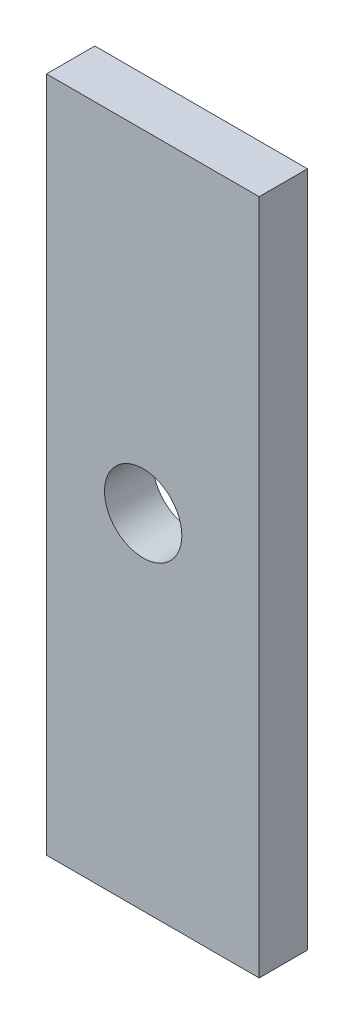
ISO-10303-21;
HEADER;
FILE_DESCRIPTION(('STEP AP214'),'2;1');
FILE_NAME('part.step','',(''),(''),'','','');
FILE_SCHEMA(('AUTOMOTIVE_DESIGN { 1 0 10303 214 1 1 1 1 }'));
ENDSEC;
DATA;
#1=APPLICATION_CONTEXT('core data for automotive mechanical design processes');
#2=APPLICATION_PROTOCOL_DEFINITION('international standard','automotive_design',2000,#1);
#3=PRODUCT_CONTEXT('',#1,'mechanical');
#4=PRODUCT('Part','Part','',(#3));
#5=PRODUCT_RELATED_PRODUCT_CATEGORY('part','',(#4));
#6=PRODUCT_DEFINITION_FORMATION('','',#4);
#7=PRODUCT_DEFINITION_CONTEXT('part definition',#1,'design');
#8=PRODUCT_DEFINITION('design','',#6,#7);
#9=PRODUCT_DEFINITION_SHAPE('','',#8);
#10=(LENGTH_UNIT() NAMED_UNIT(*) SI_UNIT(.MILLI.,.METRE.));
#11=(NAMED_UNIT(*) PLANE_ANGLE_UNIT() SI_UNIT($,.RADIAN.));
#12=(NAMED_UNIT(*) SI_UNIT($,.STERADIAN.) SOLID_ANGLE_UNIT());
#13=UNCERTAINTY_MEASURE_WITH_UNIT(LENGTH_MEASURE(1.E-05),#10,'distance_accuracy_value','');
#14=(GEOMETRIC_REPRESENTATION_CONTEXT(3) GLOBAL_UNCERTAINTY_ASSIGNED_CONTEXT((#13)) GLOBAL_UNIT_ASSIGNED_CONTEXT((#10,
#11,#12)) REPRESENTATION_CONTEXT('',''));
#15=CARTESIAN_POINT('',(0.,0.,0.));
#16=DIRECTION('',(0.,0.,1.));
#17=DIRECTION('',(1.,0.,0.));
#18=AXIS2_PLACEMENT_3D('',#15,#16,#17);
#19=CARTESIAN_POINT('',(-75.,35.,2.5));
#20=DIRECTION('',(0.,-1.,0.));
#21=DIRECTION('',(0.,0.,-1.));
#22=AXIS2_PLACEMENT_3D('',#19,#20,#21);
#23=PLANE('',#22);
#24=DIRECTION('',(-1.,0.,0.));
#25=VECTOR('',#24,1.);
#26=CARTESIAN_POINT('',(-75.,35.,-2.5));
#27=LINE('',#26,#25);
#28=CARTESIAN_POINT('',(75.,35.,-2.5));
#29=VERTEX_POINT('',#28);
#30=CARTESIAN_POINT('',(53.,35.,-2.5));
#31=VERTEX_POINT('',#30);
#32=EDGE_CURVE('E91',#29,#31,#27,.T.);
#33=ORIENTED_EDGE('',*,*,#32,.T.);
#34=DIRECTION('',(0.,0.,-1.));
#35=VECTOR('',#34,1.);
#36=CARTESIAN_POINT('',(53.,35.,2.5));
#37=LINE('',#36,#35);
#38=CARTESIAN_POINT('',(53.,35.,2.5));
#39=VERTEX_POINT('',#38);
#40=EDGE_CURVE('E58',#39,#31,#37,.T.);
#41=ORIENTED_EDGE('',*,*,#40,.F.);
#42=DIRECTION('',(-1.,0.,0.));
#43=VECTOR('',#42,1.);
#44=CARTESIAN_POINT('',(-75.,35.,2.5));
#45=LINE('',#44,#43);
#46=CARTESIAN_POINT('',(75.,35.,2.5));
#47=VERTEX_POINT('',#46);
#48=EDGE_CURVE('E108',#47,#39,#45,.T.);
#49=ORIENTED_EDGE('',*,*,#48,.F.);
#50=DIRECTION('',(0.,0.,-1.));
#51=VECTOR('',#50,1.);
#52=CARTESIAN_POINT('',(75.,35.,2.5));
#53=LINE('',#52,#51);
#54=EDGE_CURVE('E11',#47,#29,#53,.T.);
#55=ORIENTED_EDGE('',*,*,#54,.T.);
#56=EDGE_LOOP('',(#33,#41,#49,#55));
#57=FACE_BOUND('',#56,.T.);
#58=ADVANCED_FACE('F43',(#57),#23,.F.);
#59=CARTESIAN_POINT('',(-75.,-35.,2.5));
#60=DIRECTION('',(0.,1.,0.));
#61=DIRECTION('',(0.,0.,1.));
#62=AXIS2_PLACEMENT_3D('',#59,#60,#61);
#63=PLANE('',#62);
#64=DIRECTION('',(1.,0.,0.));
#65=VECTOR('',#64,1.);
#66=CARTESIAN_POINT('',(-75.,-35.,2.5));
#67=LINE('',#66,#65);
#68=CARTESIAN_POINT('',(53.,-35.,2.5));
#69=VERTEX_POINT('',#68);
#70=CARTESIAN_POINT('',(75.,-35.,2.5));
#71=VERTEX_POINT('',#70);
#72=EDGE_CURVE('E67',#69,#71,#67,.T.);
#73=ORIENTED_EDGE('',*,*,#72,.F.);
#74=DIRECTION('',(0.,0.,-1.));
#75=VECTOR('',#74,1.);
#76=CARTESIAN_POINT('',(53.,-35.,2.5));
#77=LINE('',#76,#75);
#78=CARTESIAN_POINT('',(53.,-35.,-2.5));
#79=VERTEX_POINT('',#78);
#80=EDGE_CURVE('E87',#69,#79,#77,.T.);
#81=ORIENTED_EDGE('',*,*,#80,.T.);
#82=DIRECTION('',(1.,0.,0.));
#83=VECTOR('',#82,1.);
#84=CARTESIAN_POINT('',(-75.,-35.,-2.5));
#85=LINE('',#84,#83);
#86=CARTESIAN_POINT('',(75.,-35.,-2.5));
#87=VERTEX_POINT('',#86);
#88=EDGE_CURVE('E81',#79,#87,#85,.T.);
#89=ORIENTED_EDGE('',*,*,#88,.T.);
#90=DIRECTION('',(0.,0.,-1.));
#91=VECTOR('',#90,1.);
#92=CARTESIAN_POINT('',(75.,-35.,2.5));
#93=LINE('',#92,#91);
#94=EDGE_CURVE('E51',#71,#87,#93,.T.);
#95=ORIENTED_EDGE('',*,*,#94,.F.);
#96=EDGE_LOOP('',(#73,#81,#89,#95));
#97=FACE_BOUND('',#96,.T.);
#98=ADVANCED_FACE('F83',(#97),#63,.F.);
#99=CARTESIAN_POINT('',(0.,0.,2.5));
#100=DIRECTION('',(0.,0.,-1.));
#101=DIRECTION('',(-1.,0.,0.));
#102=AXIS2_PLACEMENT_3D('',#99,#100,#101);
#103=PLANE('',#102);
#104=CARTESIAN_POINT('',(63.,0.62854932506915,2.5));
#105=DIRECTION('',(0.,0.,1.));
#106=DIRECTION('',(1.,0.,0.));
#107=AXIS2_PLACEMENT_3D('',#104,#105,#106);
#108=CIRCLE('',#107,4.00000000000001);
#109=CARTESIAN_POINT('',(67.,0.62854932506915,2.5));
#110=VERTEX_POINT('',#109);
#111=EDGE_CURVE('E104',#110,#110,#108,.T.);
#112=ORIENTED_EDGE('',*,*,#111,.F.);
#113=EDGE_LOOP('',(#112));
#114=FACE_BOUND('',#113,.T.);
#115=ORIENTED_EDGE('',*,*,#48,.T.);
#116=DIRECTION('',(0.,-1.,0.));
#117=VECTOR('',#116,1.);
#118=CARTESIAN_POINT('',(53.,-35.,2.5));
#119=LINE('',#118,#117);
#120=EDGE_CURVE('E115',#39,#69,#119,.T.);
#121=ORIENTED_EDGE('',*,*,#120,.T.);
#122=ORIENTED_EDGE('',*,*,#72,.T.);
#123=DIRECTION('',(0.,1.,0.));
#124=VECTOR('',#123,1.);
#125=CARTESIAN_POINT('',(75.,-35.,2.5));
#126=LINE('',#125,#124);
#127=EDGE_CURVE('E90',#71,#47,#126,.T.);
#128=ORIENTED_EDGE('',*,*,#127,.T.);
#129=EDGE_LOOP('',(#115,#121,#122,#128));
#130=FACE_BOUND('',#129,.T.);
#131=ADVANCED_FACE('F119',(#114,#130),#103,.F.);
#132=CARTESIAN_POINT('',(0.,0.,-2.5));
#133=DIRECTION('',(0.,0.,-1.));
#134=DIRECTION('',(-1.,0.,0.));
#135=AXIS2_PLACEMENT_3D('',#132,#133,#134);
#136=PLANE('',#135);
#137=DIRECTION('',(0.,-1.,0.));
#138=VECTOR('',#137,1.);
#139=CARTESIAN_POINT('',(53.,-35.,-2.5));
#140=LINE('',#139,#138);
#141=EDGE_CURVE('E117',#31,#79,#140,.T.);
#142=ORIENTED_EDGE('',*,*,#141,.F.);
#143=ORIENTED_EDGE('',*,*,#32,.F.);
#144=DIRECTION('',(0.,1.,0.));
#145=VECTOR('',#144,1.);
#146=CARTESIAN_POINT('',(75.,-35.,-2.5));
#147=LINE('',#146,#145);
#148=EDGE_CURVE('E96',#87,#29,#147,.T.);
#149=ORIENTED_EDGE('',*,*,#148,.F.);
#150=ORIENTED_EDGE('',*,*,#88,.F.);
#151=EDGE_LOOP('',(#142,#143,#149,#150));
#152=FACE_BOUND('',#151,.T.);
#153=CARTESIAN_POINT('',(63.,0.62854932506915,-2.5));
#154=DIRECTION('',(0.,0.,1.));
#155=DIRECTION('',(1.,0.,0.));
#156=AXIS2_PLACEMENT_3D('',#153,#154,#155);
#157=CIRCLE('',#156,4.00000000000001);
#158=CARTESIAN_POINT('',(67.,0.62854932506915,-2.5));
#159=VERTEX_POINT('',#158);
#160=EDGE_CURVE('E100',#159,#159,#157,.T.);
#161=ORIENTED_EDGE('',*,*,#160,.T.);
#162=EDGE_LOOP('',(#161));
#163=FACE_BOUND('',#162,.T.);
#164=ADVANCED_FACE('F97',(#152,#163),#136,.T.);
#165=CARTESIAN_POINT('',(75.,-35.,2.5));
#166=DIRECTION('',(-1.,0.,0.));
#167=DIRECTION('',(0.,0.,1.));
#168=AXIS2_PLACEMENT_3D('',#165,#166,#167);
#169=PLANE('',#168);
#170=ORIENTED_EDGE('',*,*,#148,.T.);
#171=ORIENTED_EDGE('',*,*,#54,.F.);
#172=ORIENTED_EDGE('',*,*,#127,.F.);
#173=ORIENTED_EDGE('',*,*,#94,.T.);
#174=EDGE_LOOP('',(#170,#171,#172,#173));
#175=FACE_BOUND('',#174,.T.);
#176=ADVANCED_FACE('F45',(#175),#169,.F.);
#177=CARTESIAN_POINT('',(63.,0.62854932506915,-2.5));
#178=DIRECTION('',(0.,0.,1.));
#179=DIRECTION('',(1.,0.,0.));
#180=AXIS2_PLACEMENT_3D('',#177,#178,#179);
#181=CYLINDRICAL_SURFACE('',#180,4.00000000000001);
#182=ORIENTED_EDGE('',*,*,#160,.F.);
#183=EDGE_LOOP('',(#182));
#184=FACE_BOUND('',#183,.T.);
#185=ORIENTED_EDGE('',*,*,#111,.T.);
#186=EDGE_LOOP('',(#185));
#187=FACE_BOUND('',#186,.T.);
#188=ADVANCED_FACE('F137',(#184,#187),#181,.F.);
#189=CARTESIAN_POINT('',(53.,-35.,2.5));
#190=DIRECTION('',(1.,0.,0.));
#191=DIRECTION('',(0.,0.,-1.));
#192=AXIS2_PLACEMENT_3D('',#189,#190,#191);
#193=PLANE('',#192);
#194=ORIENTED_EDGE('',*,*,#141,.T.);
#195=ORIENTED_EDGE('',*,*,#80,.F.);
#196=ORIENTED_EDGE('',*,*,#120,.F.);
#197=ORIENTED_EDGE('',*,*,#40,.T.);
#198=EDGE_LOOP('',(#194,#195,#196,#197));
#199=FACE_BOUND('',#198,.T.);
#200=ADVANCED_FACE('F122',(#199),#193,.F.);
#201=CLOSED_SHELL('',(#58,#98,#131,#164,#176,#188,#200));
#202=MANIFOLD_SOLID_BREP('B2',#201);
#203=ADVANCED_BREP_SHAPE_REPRESENTATION('',(#18,#202),#14);
#204=SHAPE_DEFINITION_REPRESENTATION(#9,#203);
ENDSEC;
END-ISO-10303-21;
